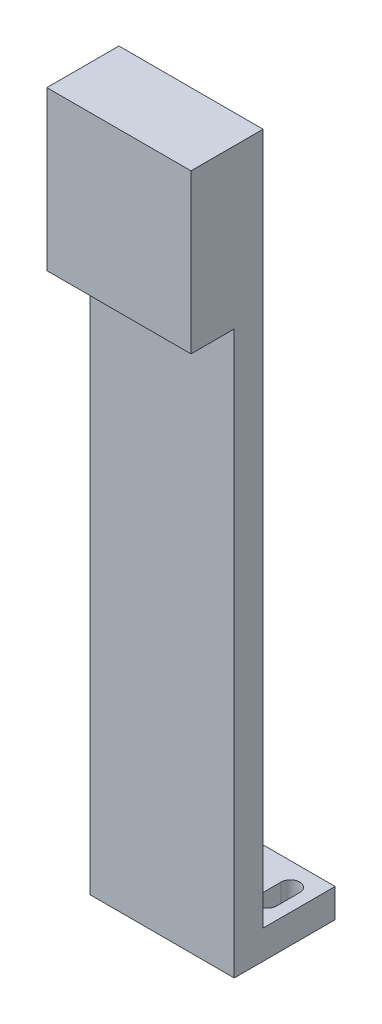
ISO-10303-21;
HEADER;
FILE_DESCRIPTION(('STEP AP214'),'2;1');
FILE_NAME('part.step','',(''),(''),'','','');
FILE_SCHEMA(('AUTOMOTIVE_DESIGN { 1 0 10303 214 1 1 1 1 }'));
ENDSEC;
DATA;
#1=APPLICATION_CONTEXT('core data for automotive mechanical design processes');
#2=APPLICATION_PROTOCOL_DEFINITION('international standard','automotive_design',2000,#1);
#3=PRODUCT_CONTEXT('',#1,'mechanical');
#4=PRODUCT('Part','Part','',(#3));
#5=PRODUCT_RELATED_PRODUCT_CATEGORY('part','',(#4));
#6=PRODUCT_DEFINITION_FORMATION('','',#4);
#7=PRODUCT_DEFINITION_CONTEXT('part definition',#1,'design');
#8=PRODUCT_DEFINITION('design','',#6,#7);
#9=PRODUCT_DEFINITION_SHAPE('','',#8);
#10=(LENGTH_UNIT() NAMED_UNIT(*) SI_UNIT(.MILLI.,.METRE.));
#11=(NAMED_UNIT(*) PLANE_ANGLE_UNIT() SI_UNIT($,.RADIAN.));
#12=(NAMED_UNIT(*) SI_UNIT($,.STERADIAN.) SOLID_ANGLE_UNIT());
#13=UNCERTAINTY_MEASURE_WITH_UNIT(LENGTH_MEASURE(1.E-05),#10,'distance_accuracy_value','');
#14=(GEOMETRIC_REPRESENTATION_CONTEXT(3) GLOBAL_UNCERTAINTY_ASSIGNED_CONTEXT((#13)) GLOBAL_UNIT_ASSIGNED_CONTEXT((#10,
#11,#12)) REPRESENTATION_CONTEXT('',''));
#15=CARTESIAN_POINT('',(0.,0.,0.));
#16=DIRECTION('',(0.,0.,1.));
#17=DIRECTION('',(1.,0.,0.));
#18=AXIS2_PLACEMENT_3D('',#15,#16,#17);
#19=CARTESIAN_POINT('',(25.,250.,17.5));
#20=DIRECTION('',(0.,0.,-1.));
#21=DIRECTION('',(-1.,0.,0.));
#22=AXIS2_PLACEMENT_3D('',#19,#20,#21);
#23=PLANE('',#22);
#24=DIRECTION('',(1.,0.,0.));
#25=VECTOR('',#24,1.);
#26=CARTESIAN_POINT('',(-25.,195.,17.5));
#27=LINE('',#26,#25);
#28=CARTESIAN_POINT('',(-25.,195.,17.5));
#29=VERTEX_POINT('',#28);
#30=CARTESIAN_POINT('',(25.,195.,17.5));
#31=VERTEX_POINT('',#30);
#32=EDGE_CURVE('E52',#29,#31,#27,.T.);
#33=ORIENTED_EDGE('',*,*,#32,.F.);
#34=DIRECTION('',(0.,-1.,0.));
#35=VECTOR('',#34,1.);
#36=CARTESIAN_POINT('',(-25.,250.,17.5));
#37=LINE('',#36,#35);
#38=CARTESIAN_POINT('',(-25.,0.,17.5));
#39=VERTEX_POINT('',#38);
#40=EDGE_CURVE('E12',#29,#39,#37,.T.);
#41=ORIENTED_EDGE('',*,*,#40,.T.);
#42=DIRECTION('',(1.,0.,0.));
#43=VECTOR('',#42,1.);
#44=CARTESIAN_POINT('',(25.,0.,17.5));
#45=LINE('',#44,#43);
#46=CARTESIAN_POINT('',(25.,0.,17.5));
#47=VERTEX_POINT('',#46);
#48=EDGE_CURVE('E272',#39,#47,#45,.T.);
#49=ORIENTED_EDGE('',*,*,#48,.T.);
#50=DIRECTION('',(0.,-1.,0.));
#51=VECTOR('',#50,1.);
#52=CARTESIAN_POINT('',(25.,250.,17.5));
#53=LINE('',#52,#51);
#54=EDGE_CURVE('E45',#31,#47,#53,.T.);
#55=ORIENTED_EDGE('',*,*,#54,.F.);
#56=EDGE_LOOP('',(#33,#41,#49,#55));
#57=FACE_BOUND('',#56,.T.);
#58=ADVANCED_FACE('F36',(#57),#23,.F.);
#59=CARTESIAN_POINT('',(25.,250.,-17.5));
#60=DIRECTION('',(0.,0.,1.));
#61=DIRECTION('',(1.,0.,0.));
#62=AXIS2_PLACEMENT_3D('',#59,#60,#61);
#63=PLANE('',#62);
#64=DIRECTION('',(1.,0.,0.));
#65=VECTOR('',#64,1.);
#66=CARTESIAN_POINT('',(-25.,9.99999999999999,-17.5));
#67=LINE('',#66,#65);
#68=CARTESIAN_POINT('',(-25.,9.99999999999999,-17.5));
#69=VERTEX_POINT('',#68);
#70=CARTESIAN_POINT('',(25.,9.99999999999999,-17.5));
#71=VERTEX_POINT('',#70);
#72=EDGE_CURVE('E249',#69,#71,#67,.T.);
#73=ORIENTED_EDGE('',*,*,#72,.T.);
#74=DIRECTION('',(0.,-1.,0.));
#75=VECTOR('',#74,1.);
#76=CARTESIAN_POINT('',(25.,250.,-17.5));
#77=LINE('',#76,#75);
#78=CARTESIAN_POINT('',(25.,0.,-17.5));
#79=VERTEX_POINT('',#78);
#80=EDGE_CURVE('E281',#71,#79,#77,.T.);
#81=ORIENTED_EDGE('',*,*,#80,.T.);
#82=DIRECTION('',(-1.,0.,0.));
#83=VECTOR('',#82,1.);
#84=CARTESIAN_POINT('',(25.,0.,-17.5));
#85=LINE('',#84,#83);
#86=CARTESIAN_POINT('',(-25.,0.,-17.5));
#87=VERTEX_POINT('',#86);
#88=EDGE_CURVE('E267',#79,#87,#85,.T.);
#89=ORIENTED_EDGE('',*,*,#88,.T.);
#90=DIRECTION('',(0.,-1.,0.));
#91=VECTOR('',#90,1.);
#92=CARTESIAN_POINT('',(-25.,250.,-17.5));
#93=LINE('',#92,#91);
#94=EDGE_CURVE('E270',#69,#87,#93,.T.);
#95=ORIENTED_EDGE('',*,*,#94,.F.);
#96=EDGE_LOOP('',(#73,#81,#89,#95));
#97=FACE_BOUND('',#96,.T.);
#98=ADVANCED_FACE('F296',(#97),#63,.F.);
#99=CARTESIAN_POINT('',(-25.,250.,17.5));
#100=DIRECTION('',(1.,0.,0.));
#101=DIRECTION('',(0.,0.,-1.));
#102=AXIS2_PLACEMENT_3D('',#99,#100,#101);
#103=PLANE('',#102);
#104=DIRECTION('',(0.,0.,1.));
#105=VECTOR('',#104,1.);
#106=CARTESIAN_POINT('',(-25.,250.,17.5));
#107=LINE('',#106,#105);
#108=CARTESIAN_POINT('',(-25.,250.,7.5));
#109=VERTEX_POINT('',#108);
#110=CARTESIAN_POINT('',(-25.,250.,32.5));
#111=VERTEX_POINT('',#110);
#112=EDGE_CURVE('E264',#109,#111,#107,.T.);
#113=ORIENTED_EDGE('',*,*,#112,.F.);
#114=DIRECTION('',(0.,1.,0.));
#115=VECTOR('',#114,1.);
#116=CARTESIAN_POINT('',(-25.,-55.9016994374948,7.5));
#117=LINE('',#116,#115);
#118=CARTESIAN_POINT('',(-25.,9.99999999999999,7.5));
#119=VERTEX_POINT('',#118);
#120=EDGE_CURVE('E258',#119,#109,#117,.T.);
#121=ORIENTED_EDGE('',*,*,#120,.F.);
#122=DIRECTION('',(0.,0.,-1.));
#123=VECTOR('',#122,1.);
#124=CARTESIAN_POINT('',(-25.,9.99999999999999,-17.5));
#125=LINE('',#124,#123);
#126=EDGE_CURVE('E253',#119,#69,#125,.T.);
#127=ORIENTED_EDGE('',*,*,#126,.T.);
#128=ORIENTED_EDGE('',*,*,#94,.T.);
#129=DIRECTION('',(0.,0.,1.));
#130=VECTOR('',#129,1.);
#131=CARTESIAN_POINT('',(-25.,0.,17.5));
#132=LINE('',#131,#130);
#133=EDGE_CURVE('E263',#87,#39,#132,.T.);
#134=ORIENTED_EDGE('',*,*,#133,.T.);
#135=ORIENTED_EDGE('',*,*,#40,.F.);
#136=DIRECTION('',(0.,0.,-1.));
#137=VECTOR('',#136,1.);
#138=CARTESIAN_POINT('',(-25.,195.,32.5));
#139=LINE('',#138,#137);
#140=CARTESIAN_POINT('',(-25.,195.,32.5));
#141=VERTEX_POINT('',#140);
#142=EDGE_CURVE('E154',#141,#29,#139,.T.);
#143=ORIENTED_EDGE('',*,*,#142,.F.);
#144=DIRECTION('',(0.,-1.,0.));
#145=VECTOR('',#144,1.);
#146=CARTESIAN_POINT('',(-25.,250.,32.5));
#147=LINE('',#146,#145);
#148=EDGE_CURVE('E161',#111,#141,#147,.T.);
#149=ORIENTED_EDGE('',*,*,#148,.F.);
#150=EDGE_LOOP('',(#113,#121,#127,#128,#134,#135,#143,#149));
#151=FACE_BOUND('',#150,.T.);
#152=ADVANCED_FACE('F38',(#151),#103,.F.);
#153=CARTESIAN_POINT('',(25.,250.,17.5));
#154=DIRECTION('',(-1.,0.,0.));
#155=DIRECTION('',(0.,0.,1.));
#156=AXIS2_PLACEMENT_3D('',#153,#154,#155);
#157=PLANE('',#156);
#158=DIRECTION('',(0.,0.,1.));
#159=VECTOR('',#158,1.);
#160=CARTESIAN_POINT('',(25.,9.99999999999999,-17.5));
#161=LINE('',#160,#159);
#162=CARTESIAN_POINT('',(25.,9.99999999999999,7.50000000000001));
#163=VERTEX_POINT('',#162);
#164=EDGE_CURVE('E246',#71,#163,#161,.T.);
#165=ORIENTED_EDGE('',*,*,#164,.T.);
#166=DIRECTION('',(0.,1.,0.));
#167=VECTOR('',#166,1.);
#168=CARTESIAN_POINT('',(25.,-55.9016994374948,7.50000000000001));
#169=LINE('',#168,#167);
#170=CARTESIAN_POINT('',(25.,250.,7.50000000000001));
#171=VERTEX_POINT('',#170);
#172=EDGE_CURVE('E250',#163,#171,#169,.T.);
#173=ORIENTED_EDGE('',*,*,#172,.T.);
#174=DIRECTION('',(0.,0.,-1.));
#175=VECTOR('',#174,1.);
#176=CARTESIAN_POINT('',(25.,250.,17.5));
#177=LINE('',#176,#175);
#178=CARTESIAN_POINT('',(25.,250.,32.5));
#179=VERTEX_POINT('',#178);
#180=EDGE_CURVE('E266',#179,#171,#177,.T.);
#181=ORIENTED_EDGE('',*,*,#180,.F.);
#182=DIRECTION('',(0.,1.,0.));
#183=VECTOR('',#182,1.);
#184=CARTESIAN_POINT('',(25.,250.,32.5));
#185=LINE('',#184,#183);
#186=CARTESIAN_POINT('',(25.,195.,32.5));
#187=VERTEX_POINT('',#186);
#188=EDGE_CURVE('E160',#187,#179,#185,.T.);
#189=ORIENTED_EDGE('',*,*,#188,.F.);
#190=DIRECTION('',(0.,0.,-1.));
#191=VECTOR('',#190,1.);
#192=CARTESIAN_POINT('',(25.,195.,32.5));
#193=LINE('',#192,#191);
#194=EDGE_CURVE('E156',#187,#31,#193,.T.);
#195=ORIENTED_EDGE('',*,*,#194,.T.);
#196=ORIENTED_EDGE('',*,*,#54,.T.);
#197=DIRECTION('',(0.,0.,-1.));
#198=VECTOR('',#197,1.);
#199=CARTESIAN_POINT('',(25.,0.,17.5));
#200=LINE('',#199,#198);
#201=EDGE_CURVE('E275',#47,#79,#200,.T.);
#202=ORIENTED_EDGE('',*,*,#201,.T.);
#203=ORIENTED_EDGE('',*,*,#80,.F.);
#204=EDGE_LOOP('',(#165,#173,#181,#189,#195,#196,#202,#203));
#205=FACE_BOUND('',#204,.T.);
#206=ADVANCED_FACE('F286',(#205),#157,.F.);
#207=CARTESIAN_POINT('',(0.,250.,0.));
#208=DIRECTION('',(0.,1.,0.));
#209=DIRECTION('',(0.,0.,1.));
#210=AXIS2_PLACEMENT_3D('',#207,#208,#209);
#211=PLANE('',#210);
#212=DIRECTION('',(1.,0.,0.));
#213=VECTOR('',#212,1.);
#214=CARTESIAN_POINT('',(-25.,250.,7.5));
#215=LINE('',#214,#213);
#216=EDGE_CURVE('E239',#109,#171,#215,.T.);
#217=ORIENTED_EDGE('',*,*,#216,.F.);
#218=ORIENTED_EDGE('',*,*,#112,.T.);
#219=DIRECTION('',(-1.,0.,0.));
#220=VECTOR('',#219,1.);
#221=CARTESIAN_POINT('',(-25.,250.,32.5));
#222=LINE('',#221,#220);
#223=EDGE_CURVE('E167',#179,#111,#222,.T.);
#224=ORIENTED_EDGE('',*,*,#223,.F.);
#225=ORIENTED_EDGE('',*,*,#180,.T.);
#226=EDGE_LOOP('',(#217,#218,#224,#225));
#227=FACE_BOUND('',#226,.T.);
#228=ADVANCED_FACE('F306',(#227),#211,.T.);
#229=CARTESIAN_POINT('',(0.,0.,0.));
#230=DIRECTION('',(0.,1.,0.));
#231=DIRECTION('',(0.,0.,1.));
#232=AXIS2_PLACEMENT_3D('',#229,#230,#231);
#233=PLANE('',#232);
#234=DIRECTION('',(0.,0.,1.));
#235=VECTOR('',#234,1.);
#236=CARTESIAN_POINT('',(14.3,0.,-1.5));
#237=LINE('',#236,#235);
#238=CARTESIAN_POINT('',(14.3,0.,-9.5));
#239=VERTEX_POINT('',#238);
#240=CARTESIAN_POINT('',(14.3,0.,-1.5));
#241=VERTEX_POINT('',#240);
#242=EDGE_CURVE('E194',#239,#241,#237,.T.);
#243=ORIENTED_EDGE('',*,*,#242,.T.);
#244=CARTESIAN_POINT('',(17.5,0.,-1.5));
#245=DIRECTION('',(0.,1.,0.));
#246=DIRECTION('',(0.,0.,-1.));
#247=AXIS2_PLACEMENT_3D('',#244,#245,#246);
#248=CIRCLE('',#247,3.2);
#249=CARTESIAN_POINT('',(20.7,0.,-1.5));
#250=VERTEX_POINT('',#249);
#251=EDGE_CURVE('E186',#241,#250,#248,.T.);
#252=ORIENTED_EDGE('',*,*,#251,.T.);
#253=DIRECTION('',(0.,0.,-1.));
#254=VECTOR('',#253,1.);
#255=CARTESIAN_POINT('',(20.7,0.,-1.5));
#256=LINE('',#255,#254);
#257=CARTESIAN_POINT('',(20.7,0.,-9.5));
#258=VERTEX_POINT('',#257);
#259=EDGE_CURVE('E189',#250,#258,#256,.T.);
#260=ORIENTED_EDGE('',*,*,#259,.T.);
#261=CARTESIAN_POINT('',(17.5,0.,-9.5));
#262=DIRECTION('',(0.,1.,0.));
#263=DIRECTION('',(0.,0.,-1.));
#264=AXIS2_PLACEMENT_3D('',#261,#262,#263);
#265=CIRCLE('',#264,3.2);
#266=EDGE_CURVE('E60',#258,#239,#265,.T.);
#267=ORIENTED_EDGE('',*,*,#266,.T.);
#268=EDGE_LOOP('',(#243,#252,#260,#267));
#269=FACE_BOUND('',#268,.T.);
#270=DIRECTION('',(0.,0.,1.));
#271=VECTOR('',#270,1.);
#272=CARTESIAN_POINT('',(-20.7,0.,-1.5));
#273=LINE('',#272,#271);
#274=CARTESIAN_POINT('',(-20.7,0.,-9.5));
#275=VERTEX_POINT('',#274);
#276=CARTESIAN_POINT('',(-20.7,0.,-1.5));
#277=VERTEX_POINT('',#276);
#278=EDGE_CURVE('E224',#275,#277,#273,.T.);
#279=ORIENTED_EDGE('',*,*,#278,.T.);
#280=CARTESIAN_POINT('',(-17.5,0.,-1.5));
#281=DIRECTION('',(0.,1.,0.));
#282=DIRECTION('',(0.,0.,1.));
#283=AXIS2_PLACEMENT_3D('',#280,#281,#282);
#284=CIRCLE('',#283,3.2);
#285=CARTESIAN_POINT('',(-14.3,0.,-1.5));
#286=VERTEX_POINT('',#285);
#287=EDGE_CURVE('E214',#277,#286,#284,.T.);
#288=ORIENTED_EDGE('',*,*,#287,.T.);
#289=DIRECTION('',(0.,0.,-1.));
#290=VECTOR('',#289,1.);
#291=CARTESIAN_POINT('',(-14.3,0.,-1.5));
#292=LINE('',#291,#290);
#293=CARTESIAN_POINT('',(-14.3,0.,-9.49999999999999));
#294=VERTEX_POINT('',#293);
#295=EDGE_CURVE('E217',#286,#294,#292,.T.);
#296=ORIENTED_EDGE('',*,*,#295,.T.);
#297=CARTESIAN_POINT('',(-17.5,0.,-9.5));
#298=DIRECTION('',(0.,1.,0.));
#299=DIRECTION('',(0.,0.,1.));
#300=AXIS2_PLACEMENT_3D('',#297,#298,#299);
#301=CIRCLE('',#300,3.2);
#302=EDGE_CURVE('E221',#294,#275,#301,.T.);
#303=ORIENTED_EDGE('',*,*,#302,.T.);
#304=EDGE_LOOP('',(#279,#288,#296,#303));
#305=FACE_BOUND('',#304,.T.);
#306=ORIENTED_EDGE('',*,*,#133,.F.);
#307=ORIENTED_EDGE('',*,*,#88,.F.);
#308=ORIENTED_EDGE('',*,*,#201,.F.);
#309=ORIENTED_EDGE('',*,*,#48,.F.);
#310=EDGE_LOOP('',(#306,#307,#308,#309));
#311=FACE_BOUND('',#310,.T.);
#312=ADVANCED_FACE('F293',(#269,#305,#311),#233,.F.);
#313=CARTESIAN_POINT('',(-25.,-55.9016994374948,7.5));
#314=DIRECTION('',(0.,0.,1.));
#315=DIRECTION('',(1.,0.,0.));
#316=AXIS2_PLACEMENT_3D('',#313,#314,#315);
#317=PLANE('',#316);
#318=DIRECTION('',(-1.,0.,0.));
#319=VECTOR('',#318,1.);
#320=CARTESIAN_POINT('',(-25.,9.99999999999999,7.5));
#321=LINE('',#320,#319);
#322=EDGE_CURVE('E256',#163,#119,#321,.T.);
#323=ORIENTED_EDGE('',*,*,#322,.T.);
#324=ORIENTED_EDGE('',*,*,#120,.T.);
#325=ORIENTED_EDGE('',*,*,#216,.T.);
#326=ORIENTED_EDGE('',*,*,#172,.F.);
#327=EDGE_LOOP('',(#323,#324,#325,#326));
#328=FACE_BOUND('',#327,.T.);
#329=ADVANCED_FACE('F303',(#328),#317,.F.);
#330=CARTESIAN_POINT('',(0.,10.,0.));
#331=DIRECTION('',(0.,1.,0.));
#332=DIRECTION('',(0.,0.,1.));
#333=AXIS2_PLACEMENT_3D('',#330,#331,#332);
#334=PLANE('',#333);
#335=CARTESIAN_POINT('',(17.5,10.,-1.5));
#336=DIRECTION('',(0.,1.,0.));
#337=DIRECTION('',(0.,0.,-1.));
#338=AXIS2_PLACEMENT_3D('',#335,#336,#337);
#339=CIRCLE('',#338,3.2);
#340=CARTESIAN_POINT('',(14.3,10.,-1.5));
#341=VERTEX_POINT('',#340);
#342=CARTESIAN_POINT('',(20.7,10.,-1.5));
#343=VERTEX_POINT('',#342);
#344=EDGE_CURVE('E172',#341,#343,#339,.T.);
#345=ORIENTED_EDGE('',*,*,#344,.F.);
#346=DIRECTION('',(0.,0.,1.));
#347=VECTOR('',#346,1.);
#348=CARTESIAN_POINT('',(14.3,10.,-1.5));
#349=LINE('',#348,#347);
#350=CARTESIAN_POINT('',(14.3,10.,-9.5));
#351=VERTEX_POINT('',#350);
#352=EDGE_CURVE('E190',#351,#341,#349,.T.);
#353=ORIENTED_EDGE('',*,*,#352,.F.);
#354=CARTESIAN_POINT('',(17.5,10.,-9.5));
#355=DIRECTION('',(0.,1.,0.));
#356=DIRECTION('',(0.,0.,-1.));
#357=AXIS2_PLACEMENT_3D('',#354,#355,#356);
#358=CIRCLE('',#357,3.2);
#359=CARTESIAN_POINT('',(20.7,10.,-9.5));
#360=VERTEX_POINT('',#359);
#361=EDGE_CURVE('E200',#360,#351,#358,.T.);
#362=ORIENTED_EDGE('',*,*,#361,.F.);
#363=DIRECTION('',(0.,0.,-1.));
#364=VECTOR('',#363,1.);
#365=CARTESIAN_POINT('',(20.7,10.,-1.5));
#366=LINE('',#365,#364);
#367=EDGE_CURVE('E173',#343,#360,#366,.T.);
#368=ORIENTED_EDGE('',*,*,#367,.F.);
#369=EDGE_LOOP('',(#345,#353,#362,#368));
#370=FACE_BOUND('',#369,.T.);
#371=CARTESIAN_POINT('',(-17.5,10.,-1.5));
#372=DIRECTION('',(0.,1.,0.));
#373=DIRECTION('',(0.,0.,1.));
#374=AXIS2_PLACEMENT_3D('',#371,#372,#373);
#375=CIRCLE('',#374,3.2);
#376=CARTESIAN_POINT('',(-20.7,10.,-1.5));
#377=VERTEX_POINT('',#376);
#378=CARTESIAN_POINT('',(-14.3,10.,-1.5));
#379=VERTEX_POINT('',#378);
#380=EDGE_CURVE('E207',#377,#379,#375,.T.);
#381=ORIENTED_EDGE('',*,*,#380,.F.);
#382=DIRECTION('',(0.,0.,1.));
#383=VECTOR('',#382,1.);
#384=CARTESIAN_POINT('',(-20.7,10.,-1.5));
#385=LINE('',#384,#383);
#386=CARTESIAN_POINT('',(-20.7,10.,-9.5));
#387=VERTEX_POINT('',#386);
#388=EDGE_CURVE('E218',#387,#377,#385,.T.);
#389=ORIENTED_EDGE('',*,*,#388,.F.);
#390=CARTESIAN_POINT('',(-17.5,10.,-9.5));
#391=DIRECTION('',(0.,1.,0.));
#392=DIRECTION('',(0.,0.,1.));
#393=AXIS2_PLACEMENT_3D('',#390,#391,#392);
#394=CIRCLE('',#393,3.2);
#395=CARTESIAN_POINT('',(-14.3,10.,-9.49999999999999));
#396=VERTEX_POINT('',#395);
#397=EDGE_CURVE('E232',#396,#387,#394,.T.);
#398=ORIENTED_EDGE('',*,*,#397,.F.);
#399=DIRECTION('',(0.,0.,-1.));
#400=VECTOR('',#399,1.);
#401=CARTESIAN_POINT('',(-14.3,10.,-1.5));
#402=LINE('',#401,#400);
#403=EDGE_CURVE('E229',#379,#396,#402,.T.);
#404=ORIENTED_EDGE('',*,*,#403,.F.);
#405=EDGE_LOOP('',(#381,#389,#398,#404));
#406=FACE_BOUND('',#405,.T.);
#407=ORIENTED_EDGE('',*,*,#126,.F.);
#408=ORIENTED_EDGE('',*,*,#322,.F.);
#409=ORIENTED_EDGE('',*,*,#164,.F.);
#410=ORIENTED_EDGE('',*,*,#72,.F.);
#411=EDGE_LOOP('',(#407,#408,#409,#410));
#412=FACE_BOUND('',#411,.T.);
#413=ADVANCED_FACE('F300',(#370,#406,#412),#334,.T.);
#414=CARTESIAN_POINT('',(-17.5,0.,-1.5));
#415=DIRECTION('',(0.,1.,0.));
#416=DIRECTION('',(0.,0.,1.));
#417=AXIS2_PLACEMENT_3D('',#414,#415,#416);
#418=CYLINDRICAL_SURFACE('',#417,3.2);
#419=ORIENTED_EDGE('',*,*,#380,.T.);
#420=DIRECTION('',(0.,1.,0.));
#421=VECTOR('',#420,1.);
#422=CARTESIAN_POINT('',(-14.3,0.,-1.5));
#423=LINE('',#422,#421);
#424=EDGE_CURVE('E227',#286,#379,#423,.T.);
#425=ORIENTED_EDGE('',*,*,#424,.F.);
#426=ORIENTED_EDGE('',*,*,#287,.F.);
#427=DIRECTION('',(0.,1.,0.));
#428=VECTOR('',#427,1.);
#429=CARTESIAN_POINT('',(-20.7,0.,-1.5));
#430=LINE('',#429,#428);
#431=EDGE_CURVE('E237',#277,#377,#430,.T.);
#432=ORIENTED_EDGE('',*,*,#431,.T.);
#433=EDGE_LOOP('',(#419,#425,#426,#432));
#434=FACE_BOUND('',#433,.T.);
#435=ADVANCED_FACE('F378',(#434),#418,.F.);
#436=CARTESIAN_POINT('',(-20.7,0.,-1.5));
#437=DIRECTION('',(-1.,0.,0.));
#438=DIRECTION('',(0.,0.,1.));
#439=AXIS2_PLACEMENT_3D('',#436,#437,#438);
#440=PLANE('',#439);
#441=ORIENTED_EDGE('',*,*,#388,.T.);
#442=ORIENTED_EDGE('',*,*,#431,.F.);
#443=ORIENTED_EDGE('',*,*,#278,.F.);
#444=DIRECTION('',(0.,1.,0.));
#445=VECTOR('',#444,1.);
#446=CARTESIAN_POINT('',(-20.7,0.,-9.5));
#447=LINE('',#446,#445);
#448=EDGE_CURVE('E240',#275,#387,#447,.T.);
#449=ORIENTED_EDGE('',*,*,#448,.T.);
#450=EDGE_LOOP('',(#441,#442,#443,#449));
#451=FACE_BOUND('',#450,.T.);
#452=ADVANCED_FACE('F374',(#451),#440,.F.);
#453=CARTESIAN_POINT('',(-17.5,0.,-9.5));
#454=DIRECTION('',(0.,1.,0.));
#455=DIRECTION('',(0.,0.,1.));
#456=AXIS2_PLACEMENT_3D('',#453,#454,#455);
#457=CYLINDRICAL_SURFACE('',#456,3.2);
#458=ORIENTED_EDGE('',*,*,#397,.T.);
#459=ORIENTED_EDGE('',*,*,#448,.F.);
#460=ORIENTED_EDGE('',*,*,#302,.F.);
#461=DIRECTION('',(0.,1.,0.));
#462=VECTOR('',#461,1.);
#463=CARTESIAN_POINT('',(-14.3,0.,-9.49999999999999));
#464=LINE('',#463,#462);
#465=EDGE_CURVE('E242',#294,#396,#464,.T.);
#466=ORIENTED_EDGE('',*,*,#465,.T.);
#467=EDGE_LOOP('',(#458,#459,#460,#466));
#468=FACE_BOUND('',#467,.T.);
#469=ADVANCED_FACE('F377',(#468),#457,.F.);
#470=CARTESIAN_POINT('',(-14.3,0.,-1.5));
#471=DIRECTION('',(1.,0.,0.));
#472=DIRECTION('',(0.,0.,-1.));
#473=AXIS2_PLACEMENT_3D('',#470,#471,#472);
#474=PLANE('',#473);
#475=ORIENTED_EDGE('',*,*,#403,.T.);
#476=ORIENTED_EDGE('',*,*,#465,.F.);
#477=ORIENTED_EDGE('',*,*,#295,.F.);
#478=ORIENTED_EDGE('',*,*,#424,.T.);
#479=EDGE_LOOP('',(#475,#476,#477,#478));
#480=FACE_BOUND('',#479,.T.);
#481=ADVANCED_FACE('F372',(#480),#474,.F.);
#482=CARTESIAN_POINT('',(17.5,0.,-1.5));
#483=DIRECTION('',(0.,1.,0.));
#484=DIRECTION('',(0.,0.,1.));
#485=AXIS2_PLACEMENT_3D('',#482,#483,#484);
#486=CYLINDRICAL_SURFACE('',#485,3.2);
#487=ORIENTED_EDGE('',*,*,#344,.T.);
#488=DIRECTION('',(0.,1.,0.));
#489=VECTOR('',#488,1.);
#490=CARTESIAN_POINT('',(20.7,0.,-1.5));
#491=LINE('',#490,#489);
#492=EDGE_CURVE('E196',#250,#343,#491,.T.);
#493=ORIENTED_EDGE('',*,*,#492,.F.);
#494=ORIENTED_EDGE('',*,*,#251,.F.);
#495=DIRECTION('',(0.,1.,0.));
#496=VECTOR('',#495,1.);
#497=CARTESIAN_POINT('',(14.3,0.,-1.5));
#498=LINE('',#497,#496);
#499=EDGE_CURVE('E205',#241,#341,#498,.T.);
#500=ORIENTED_EDGE('',*,*,#499,.T.);
#501=EDGE_LOOP('',(#487,#493,#494,#500));
#502=FACE_BOUND('',#501,.T.);
#503=ADVANCED_FACE('F364',(#502),#486,.F.);
#504=CARTESIAN_POINT('',(14.3,0.,-1.5));
#505=DIRECTION('',(-1.,0.,0.));
#506=DIRECTION('',(0.,0.,1.));
#507=AXIS2_PLACEMENT_3D('',#504,#505,#506);
#508=PLANE('',#507);
#509=ORIENTED_EDGE('',*,*,#352,.T.);
#510=ORIENTED_EDGE('',*,*,#499,.F.);
#511=ORIENTED_EDGE('',*,*,#242,.F.);
#512=DIRECTION('',(0.,1.,0.));
#513=VECTOR('',#512,1.);
#514=CARTESIAN_POINT('',(14.3,0.,-9.5));
#515=LINE('',#514,#513);
#516=EDGE_CURVE('E208',#239,#351,#515,.T.);
#517=ORIENTED_EDGE('',*,*,#516,.T.);
#518=EDGE_LOOP('',(#509,#510,#511,#517));
#519=FACE_BOUND('',#518,.T.);
#520=ADVANCED_FACE('F360',(#519),#508,.F.);
#521=CARTESIAN_POINT('',(17.5,0.,-9.5));
#522=DIRECTION('',(0.,1.,0.));
#523=DIRECTION('',(0.,0.,1.));
#524=AXIS2_PLACEMENT_3D('',#521,#522,#523);
#525=CYLINDRICAL_SURFACE('',#524,3.2);
#526=ORIENTED_EDGE('',*,*,#361,.T.);
#527=ORIENTED_EDGE('',*,*,#516,.F.);
#528=ORIENTED_EDGE('',*,*,#266,.F.);
#529=DIRECTION('',(0.,1.,0.));
#530=VECTOR('',#529,1.);
#531=CARTESIAN_POINT('',(20.7,0.,-9.5));
#532=LINE('',#531,#530);
#533=EDGE_CURVE('E210',#258,#360,#532,.T.);
#534=ORIENTED_EDGE('',*,*,#533,.T.);
#535=EDGE_LOOP('',(#526,#527,#528,#534));
#536=FACE_BOUND('',#535,.T.);
#537=ADVANCED_FACE('F363',(#536),#525,.F.);
#538=CARTESIAN_POINT('',(20.7,0.,-1.5));
#539=DIRECTION('',(1.,0.,0.));
#540=DIRECTION('',(0.,0.,-1.));
#541=AXIS2_PLACEMENT_3D('',#538,#539,#540);
#542=PLANE('',#541);
#543=ORIENTED_EDGE('',*,*,#367,.T.);
#544=ORIENTED_EDGE('',*,*,#533,.F.);
#545=ORIENTED_EDGE('',*,*,#259,.F.);
#546=ORIENTED_EDGE('',*,*,#492,.T.);
#547=EDGE_LOOP('',(#543,#544,#545,#546));
#548=FACE_BOUND('',#547,.T.);
#549=ADVANCED_FACE('F346',(#548),#542,.F.);
#550=CARTESIAN_POINT('',(-25.,195.,32.5));
#551=DIRECTION('',(0.,1.,0.));
#552=DIRECTION('',(0.,0.,1.));
#553=AXIS2_PLACEMENT_3D('',#550,#551,#552);
#554=PLANE('',#553);
#555=ORIENTED_EDGE('',*,*,#32,.T.);
#556=ORIENTED_EDGE('',*,*,#194,.F.);
#557=DIRECTION('',(1.,0.,0.));
#558=VECTOR('',#557,1.);
#559=CARTESIAN_POINT('',(-25.,195.,32.5));
#560=LINE('',#559,#558);
#561=EDGE_CURVE('E150',#141,#187,#560,.T.);
#562=ORIENTED_EDGE('',*,*,#561,.F.);
#563=ORIENTED_EDGE('',*,*,#142,.T.);
#564=EDGE_LOOP('',(#555,#556,#562,#563));
#565=FACE_BOUND('',#564,.T.);
#566=ADVANCED_FACE('F152',(#565),#554,.F.);
#567=CARTESIAN_POINT('',(0.,0.,32.5));
#568=DIRECTION('',(0.,0.,1.));
#569=DIRECTION('',(1.,0.,0.));
#570=AXIS2_PLACEMENT_3D('',#567,#568,#569);
#571=PLANE('',#570);
#572=ORIENTED_EDGE('',*,*,#148,.T.);
#573=ORIENTED_EDGE('',*,*,#561,.T.);
#574=ORIENTED_EDGE('',*,*,#188,.T.);
#575=ORIENTED_EDGE('',*,*,#223,.T.);
#576=EDGE_LOOP('',(#572,#573,#574,#575));
#577=FACE_BOUND('',#576,.T.);
#578=ADVANCED_FACE('F165',(#577),#571,.T.);
#579=CLOSED_SHELL('',(#58,#98,#152,#206,#228,#312,#329,#413,#435,#452,#469,#481,#503,#520,#537,
#549,#566,#578));
#580=MANIFOLD_SOLID_BREP('B2',#579);
#581=ADVANCED_BREP_SHAPE_REPRESENTATION('',(#18,#580),#14);
#582=SHAPE_DEFINITION_REPRESENTATION(#9,#581);
ENDSEC;
END-ISO-10303-21;
